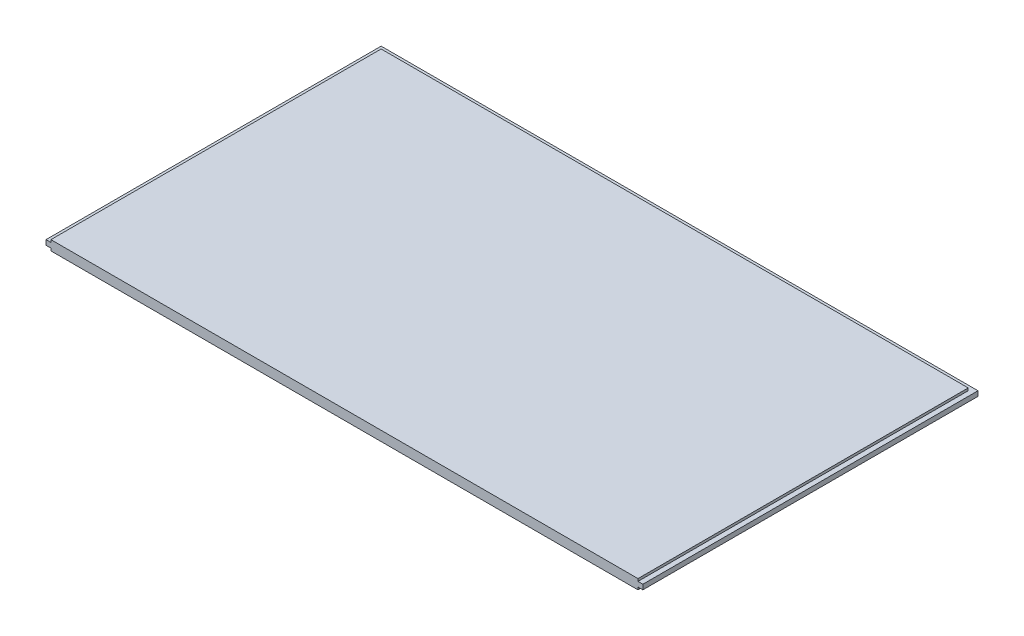
ISO-10303-21;
HEADER;
FILE_DESCRIPTION(('STEP AP214'),'2;1');
FILE_NAME('part.step','',(''),(''),'','','');
FILE_SCHEMA(('AUTOMOTIVE_DESIGN { 1 0 10303 214 1 1 1 1 }'));
ENDSEC;
DATA;
#1=APPLICATION_CONTEXT('core data for automotive mechanical design processes');
#2=APPLICATION_PROTOCOL_DEFINITION('international standard','automotive_design',2000,#1);
#3=PRODUCT_CONTEXT('',#1,'mechanical');
#4=PRODUCT('Part','Part','',(#3));
#5=PRODUCT_RELATED_PRODUCT_CATEGORY('part','',(#4));
#6=PRODUCT_DEFINITION_FORMATION('','',#4);
#7=PRODUCT_DEFINITION_CONTEXT('part definition',#1,'design');
#8=PRODUCT_DEFINITION('design','',#6,#7);
#9=PRODUCT_DEFINITION_SHAPE('','',#8);
#10=(LENGTH_UNIT() NAMED_UNIT(*) SI_UNIT(.MILLI.,.METRE.));
#11=(NAMED_UNIT(*) PLANE_ANGLE_UNIT() SI_UNIT($,.RADIAN.));
#12=(NAMED_UNIT(*) SI_UNIT($,.STERADIAN.) SOLID_ANGLE_UNIT());
#13=UNCERTAINTY_MEASURE_WITH_UNIT(LENGTH_MEASURE(1.E-05),#10,'distance_accuracy_value','');
#14=(GEOMETRIC_REPRESENTATION_CONTEXT(3) GLOBAL_UNCERTAINTY_ASSIGNED_CONTEXT((#13)) GLOBAL_UNIT_ASSIGNED_CONTEXT((#10,
#11,#12)) REPRESENTATION_CONTEXT('',''));
#15=CARTESIAN_POINT('',(0.,0.,0.));
#16=DIRECTION('',(0.,0.,1.));
#17=DIRECTION('',(1.,0.,0.));
#18=AXIS2_PLACEMENT_3D('',#15,#16,#17);
#19=CARTESIAN_POINT('',(-344.058306188925,12.7,-165.679153094463));
#20=DIRECTION('',(1.,0.,0.));
#21=DIRECTION('',(0.,0.,-1.));
#22=AXIS2_PLACEMENT_3D('',#19,#20,#21);
#23=PLANE('',#22);
#24=DIRECTION('',(0.,0.,-1.));
#25=VECTOR('',#24,1.);
#26=CARTESIAN_POINT('',(-344.058306188925,3.175,-165.679153094463));
#27=LINE('',#26,#25);
#28=CARTESIAN_POINT('',(-344.058306188925,3.17499999999991,269.295846905537));
#29=VERTEX_POINT('',#28);
#30=CARTESIAN_POINT('',(-344.058306188925,3.175,-165.679153094463));
#31=VERTEX_POINT('',#30);
#32=EDGE_CURVE('E199',#29,#31,#27,.T.);
#33=ORIENTED_EDGE('',*,*,#32,.F.);
#34=DIRECTION('',(0.,-1.,0.));
#35=VECTOR('',#34,1.);
#36=CARTESIAN_POINT('',(-344.058306188925,12.7,269.295846905537));
#37=LINE('',#36,#35);
#38=CARTESIAN_POINT('',(-344.058306188925,9.52500000000009,269.295846905537));
#39=VERTEX_POINT('',#38);
#40=EDGE_CURVE('E159',#39,#29,#37,.T.);
#41=ORIENTED_EDGE('',*,*,#40,.F.);
#42=DIRECTION('',(0.,0.,1.));
#43=VECTOR('',#42,1.);
#44=CARTESIAN_POINT('',(-344.058306188925,9.525,-165.679153094463));
#45=LINE('',#44,#43);
#46=CARTESIAN_POINT('',(-344.058306188925,9.525,-165.679153094463));
#47=VERTEX_POINT('',#46);
#48=EDGE_CURVE('E207',#47,#39,#45,.T.);
#49=ORIENTED_EDGE('',*,*,#48,.F.);
#50=DIRECTION('',(0.,-1.,0.));
#51=VECTOR('',#50,1.);
#52=CARTESIAN_POINT('',(-344.058306188925,12.7,-165.679153094463));
#53=LINE('',#52,#51);
#54=EDGE_CURVE('E142',#47,#31,#53,.T.);
#55=ORIENTED_EDGE('',*,*,#54,.T.);
#56=EDGE_LOOP('',(#33,#41,#49,#55));
#57=FACE_BOUND('',#56,.T.);
#58=ADVANCED_FACE('F33',(#57),#23,.F.);
#59=CARTESIAN_POINT('',(-344.058306188925,12.7,269.295846905537));
#60=DIRECTION('',(0.,0.,-1.));
#61=DIRECTION('',(-1.,0.,0.));
#62=AXIS2_PLACEMENT_3D('',#59,#60,#61);
#63=PLANE('',#62);
#64=DIRECTION('',(0.,-1.,0.));
#65=VECTOR('',#64,1.);
#66=CARTESIAN_POINT('',(430.641693811075,12.7,269.295846905537));
#67=LINE('',#66,#65);
#68=CARTESIAN_POINT('',(430.641693811075,9.52500000000009,269.295846905537));
#69=VERTEX_POINT('',#68);
#70=CARTESIAN_POINT('',(430.641693811075,3.17499999999991,269.295846905537));
#71=VERTEX_POINT('',#70);
#72=EDGE_CURVE('E157',#69,#71,#67,.T.);
#73=ORIENTED_EDGE('',*,*,#72,.F.);
#74=DIRECTION('',(1.,0.,0.));
#75=VECTOR('',#74,1.);
#76=CARTESIAN_POINT('',(430.641693811075,9.52500000000009,269.295846905537));
#77=LINE('',#76,#75);
#78=CARTESIAN_POINT('',(424.291693811075,9.52500000000009,269.295846905537));
#79=VERTEX_POINT('',#78);
#80=EDGE_CURVE('E128',#79,#69,#77,.T.);
#81=ORIENTED_EDGE('',*,*,#80,.F.);
#82=DIRECTION('',(0.,-1.,0.));
#83=VECTOR('',#82,1.);
#84=CARTESIAN_POINT('',(424.291693811075,12.7000000000001,269.295846905537));
#85=LINE('',#84,#83);
#86=CARTESIAN_POINT('',(424.291693811075,12.7000000000001,269.295846905537));
#87=VERTEX_POINT('',#86);
#88=EDGE_CURVE('E122',#87,#79,#85,.T.);
#89=ORIENTED_EDGE('',*,*,#88,.F.);
#90=DIRECTION('',(1.,0.,0.));
#91=VECTOR('',#90,1.);
#92=CARTESIAN_POINT('',(-344.058306188925,12.7,269.295846905537));
#93=LINE('',#92,#91);
#94=CARTESIAN_POINT('',(-337.708306188925,12.7000000000001,269.295846905537));
#95=VERTEX_POINT('',#94);
#96=EDGE_CURVE('E135',#95,#87,#93,.T.);
#97=ORIENTED_EDGE('',*,*,#96,.F.);
#98=DIRECTION('',(0.,1.,0.));
#99=VECTOR('',#98,1.);
#100=CARTESIAN_POINT('',(-337.708306188925,12.7000000000001,269.295846905537));
#101=LINE('',#100,#99);
#102=CARTESIAN_POINT('',(-337.708306188925,9.52500000000009,269.295846905537));
#103=VERTEX_POINT('',#102);
#104=EDGE_CURVE('E191',#103,#95,#101,.T.);
#105=ORIENTED_EDGE('',*,*,#104,.F.);
#106=DIRECTION('',(1.,0.,0.));
#107=VECTOR('',#106,1.);
#108=CARTESIAN_POINT('',(-344.058306188925,9.52500000000009,269.295846905537));
#109=LINE('',#108,#107);
#110=EDGE_CURVE('E183',#39,#103,#109,.T.);
#111=ORIENTED_EDGE('',*,*,#110,.F.);
#112=ORIENTED_EDGE('',*,*,#40,.T.);
#113=DIRECTION('',(-1.,0.,0.));
#114=VECTOR('',#113,1.);
#115=CARTESIAN_POINT('',(-344.058306188925,3.17499999999991,269.295846905537));
#116=LINE('',#115,#114);
#117=CARTESIAN_POINT('',(-337.708306188925,3.17499999999991,269.295846905537));
#118=VERTEX_POINT('',#117);
#119=EDGE_CURVE('E181',#118,#29,#116,.T.);
#120=ORIENTED_EDGE('',*,*,#119,.F.);
#121=DIRECTION('',(0.,1.,0.));
#122=VECTOR('',#121,1.);
#123=CARTESIAN_POINT('',(-337.708306188925,0.,269.295846905537));
#124=LINE('',#123,#122);
#125=CARTESIAN_POINT('',(-337.708306188925,0.,269.295846905537));
#126=VERTEX_POINT('',#125);
#127=EDGE_CURVE('E186',#126,#118,#124,.T.);
#128=ORIENTED_EDGE('',*,*,#127,.F.);
#129=DIRECTION('',(1.,0.,0.));
#130=VECTOR('',#129,1.);
#131=CARTESIAN_POINT('',(-344.058306188925,0.,269.295846905537));
#132=LINE('',#131,#130);
#133=CARTESIAN_POINT('',(424.291693811075,2.67494359995624E-12,269.295846905537));
#134=VERTEX_POINT('',#133);
#135=EDGE_CURVE('E143',#126,#134,#132,.T.);
#136=ORIENTED_EDGE('',*,*,#135,.T.);
#137=DIRECTION('',(0.,-1.,0.));
#138=VECTOR('',#137,1.);
#139=CARTESIAN_POINT('',(424.291693811075,2.67494359995624E-12,269.295846905537));
#140=LINE('',#139,#138);
#141=CARTESIAN_POINT('',(424.291693811075,3.17499999999991,269.295846905537));
#142=VERTEX_POINT('',#141);
#143=EDGE_CURVE('E237',#142,#134,#140,.T.);
#144=ORIENTED_EDGE('',*,*,#143,.F.);
#145=DIRECTION('',(-1.,0.,0.));
#146=VECTOR('',#145,1.);
#147=CARTESIAN_POINT('',(430.641693811075,3.17499999999991,269.295846905537));
#148=LINE('',#147,#146);
#149=EDGE_CURVE('E235',#71,#142,#148,.T.);
#150=ORIENTED_EDGE('',*,*,#149,.F.);
#151=EDGE_LOOP('',(#73,#81,#89,#97,#105,#111,#112,#120,#128,#136,#144,#150));
#152=FACE_BOUND('',#151,.T.);
#153=ADVANCED_FACE('F133',(#152),#63,.F.);
#154=CARTESIAN_POINT('',(430.641693811075,12.7,-165.679153094463));
#155=DIRECTION('',(-1.,0.,0.));
#156=DIRECTION('',(0.,0.,1.));
#157=AXIS2_PLACEMENT_3D('',#154,#155,#156);
#158=PLANE('',#157);
#159=DIRECTION('',(0.,0.,1.));
#160=VECTOR('',#159,1.);
#161=CARTESIAN_POINT('',(430.641693811075,9.525,-165.679153094463));
#162=LINE('',#161,#160);
#163=CARTESIAN_POINT('',(430.641693811075,9.525,-165.679153094463));
#164=VERTEX_POINT('',#163);
#165=EDGE_CURVE('E210',#164,#69,#162,.T.);
#166=ORIENTED_EDGE('',*,*,#165,.T.);
#167=ORIENTED_EDGE('',*,*,#72,.T.);
#168=DIRECTION('',(0.,0.,-1.));
#169=VECTOR('',#168,1.);
#170=CARTESIAN_POINT('',(430.641693811075,3.175,-165.679153094463));
#171=LINE('',#170,#169);
#172=CARTESIAN_POINT('',(430.641693811075,3.175,-165.679153094463));
#173=VERTEX_POINT('',#172);
#174=EDGE_CURVE('E200',#71,#173,#171,.T.);
#175=ORIENTED_EDGE('',*,*,#174,.T.);
#176=DIRECTION('',(0.,-1.,0.));
#177=VECTOR('',#176,1.);
#178=CARTESIAN_POINT('',(430.641693811075,12.7,-165.679153094463));
#179=LINE('',#178,#177);
#180=EDGE_CURVE('E146',#164,#173,#179,.T.);
#181=ORIENTED_EDGE('',*,*,#180,.F.);
#182=EDGE_LOOP('',(#166,#167,#175,#181));
#183=FACE_BOUND('',#182,.T.);
#184=ADVANCED_FACE('F250',(#183),#158,.F.);
#185=CARTESIAN_POINT('',(-344.058306188925,12.7,-165.679153094463));
#186=DIRECTION('',(0.,0.,1.));
#187=DIRECTION('',(1.,0.,0.));
#188=AXIS2_PLACEMENT_3D('',#185,#186,#187);
#189=PLANE('',#188);
#190=ORIENTED_EDGE('',*,*,#180,.T.);
#191=DIRECTION('',(-1.,0.,0.));
#192=VECTOR('',#191,1.);
#193=CARTESIAN_POINT('',(430.641693811075,3.175,-165.679153094463));
#194=LINE('',#193,#192);
#195=EDGE_CURVE('E205',#173,#31,#194,.T.);
#196=ORIENTED_EDGE('',*,*,#195,.T.);
#197=ORIENTED_EDGE('',*,*,#54,.F.);
#198=DIRECTION('',(-1.,0.,0.));
#199=VECTOR('',#198,1.);
#200=CARTESIAN_POINT('',(430.641693811075,9.525,-165.679153094463));
#201=LINE('',#200,#199);
#202=EDGE_CURVE('E152',#164,#47,#201,.T.);
#203=ORIENTED_EDGE('',*,*,#202,.F.);
#204=EDGE_LOOP('',(#190,#196,#197,#203));
#205=FACE_BOUND('',#204,.T.);
#206=ADVANCED_FACE('F227',(#205),#189,.F.);
#207=CARTESIAN_POINT('',(0.,12.7,0.));
#208=DIRECTION('',(0.,1.,0.));
#209=DIRECTION('',(0.,0.,1.));
#210=AXIS2_PLACEMENT_3D('',#207,#208,#209);
#211=PLANE('',#210);
#212=DIRECTION('',(0.,0.,1.));
#213=VECTOR('',#212,1.);
#214=CARTESIAN_POINT('',(424.291693811075,12.7000000000001,-165.679153094463));
#215=LINE('',#214,#213);
#216=CARTESIAN_POINT('',(424.291693811075,12.7000000000001,-159.329153094463));
#217=VERTEX_POINT('',#216);
#218=EDGE_CURVE('E119',#217,#87,#215,.T.);
#219=ORIENTED_EDGE('',*,*,#218,.F.);
#220=DIRECTION('',(-1.,0.,0.));
#221=VECTOR('',#220,1.);
#222=CARTESIAN_POINT('',(430.641693811075,12.7,-159.329153094463));
#223=LINE('',#222,#221);
#224=CARTESIAN_POINT('',(-337.708306188925,12.7000000000001,-159.329153094463));
#225=VERTEX_POINT('',#224);
#226=EDGE_CURVE('E149',#217,#225,#223,.T.);
#227=ORIENTED_EDGE('',*,*,#226,.T.);
#228=DIRECTION('',(0.,0.,1.));
#229=VECTOR('',#228,1.);
#230=CARTESIAN_POINT('',(-337.708306188925,12.7000000000001,-165.679153094463));
#231=LINE('',#230,#229);
#232=EDGE_CURVE('E141',#225,#95,#231,.T.);
#233=ORIENTED_EDGE('',*,*,#232,.T.);
#234=ORIENTED_EDGE('',*,*,#96,.T.);
#235=EDGE_LOOP('',(#219,#227,#233,#234));
#236=FACE_BOUND('',#235,.T.);
#237=ADVANCED_FACE('F139',(#236),#211,.T.);
#238=CARTESIAN_POINT('',(0.,0.,0.));
#239=DIRECTION('',(0.,1.,0.));
#240=DIRECTION('',(0.,0.,1.));
#241=AXIS2_PLACEMENT_3D('',#238,#239,#240);
#242=PLANE('',#241);
#243=DIRECTION('',(-1.,0.,0.));
#244=VECTOR('',#243,1.);
#245=CARTESIAN_POINT('',(430.641693811075,0.,-159.329153094463));
#246=LINE('',#245,#244);
#247=CARTESIAN_POINT('',(424.291693811075,2.67494359995624E-12,-159.329153094463));
#248=VERTEX_POINT('',#247);
#249=CARTESIAN_POINT('',(-337.708306188925,0.,-159.329153094463));
#250=VERTEX_POINT('',#249);
#251=EDGE_CURVE('E168',#248,#250,#246,.T.);
#252=ORIENTED_EDGE('',*,*,#251,.F.);
#253=DIRECTION('',(0.,0.,1.));
#254=VECTOR('',#253,1.);
#255=CARTESIAN_POINT('',(424.291693811075,2.67494359995624E-12,-165.679153094463));
#256=LINE('',#255,#254);
#257=EDGE_CURVE('E242',#248,#134,#256,.T.);
#258=ORIENTED_EDGE('',*,*,#257,.T.);
#259=ORIENTED_EDGE('',*,*,#135,.F.);
#260=DIRECTION('',(0.,0.,1.));
#261=VECTOR('',#260,1.);
#262=CARTESIAN_POINT('',(-337.708306188925,0.,-165.679153094463));
#263=LINE('',#262,#261);
#264=EDGE_CURVE('E174',#250,#126,#263,.T.);
#265=ORIENTED_EDGE('',*,*,#264,.F.);
#266=EDGE_LOOP('',(#252,#258,#259,#265));
#267=FACE_BOUND('',#266,.T.);
#268=ADVANCED_FACE('F179',(#267),#242,.F.);
#269=CARTESIAN_POINT('',(430.641693811075,12.7,-159.329153094463));
#270=DIRECTION('',(0.,0.,1.));
#271=DIRECTION('',(1.,0.,0.));
#272=AXIS2_PLACEMENT_3D('',#269,#270,#271);
#273=PLANE('',#272);
#274=ORIENTED_EDGE('',*,*,#226,.F.);
#275=DIRECTION('',(0.,-1.,0.));
#276=VECTOR('',#275,1.);
#277=CARTESIAN_POINT('',(424.291693811075,12.7,-159.329153094463));
#278=LINE('',#277,#276);
#279=CARTESIAN_POINT('',(424.291693811075,9.525,-159.329153094463));
#280=VERTEX_POINT('',#279);
#281=EDGE_CURVE('E124',#217,#280,#278,.T.);
#282=ORIENTED_EDGE('',*,*,#281,.T.);
#283=DIRECTION('',(-1.,0.,0.));
#284=VECTOR('',#283,1.);
#285=CARTESIAN_POINT('',(430.641693811075,9.525,-159.329153094463));
#286=LINE('',#285,#284);
#287=CARTESIAN_POINT('',(-337.708306188925,9.525,-159.329153094463));
#288=VERTEX_POINT('',#287);
#289=EDGE_CURVE('E213',#280,#288,#286,.T.);
#290=ORIENTED_EDGE('',*,*,#289,.T.);
#291=DIRECTION('',(0.,1.,0.));
#292=VECTOR('',#291,1.);
#293=CARTESIAN_POINT('',(-337.708306188925,12.7,-159.329153094463));
#294=LINE('',#293,#292);
#295=EDGE_CURVE('E195',#288,#225,#294,.T.);
#296=ORIENTED_EDGE('',*,*,#295,.T.);
#297=EDGE_LOOP('',(#274,#282,#290,#296));
#298=FACE_BOUND('',#297,.T.);
#299=ADVANCED_FACE('F234',(#298),#273,.F.);
#300=CARTESIAN_POINT('',(430.641693811075,9.525,-165.679153094463));
#301=DIRECTION('',(0.,-1.,0.));
#302=DIRECTION('',(0.,0.,-1.));
#303=AXIS2_PLACEMENT_3D('',#300,#301,#302);
#304=PLANE('',#303);
#305=ORIENTED_EDGE('',*,*,#289,.F.);
#306=DIRECTION('',(0.,0.,1.));
#307=VECTOR('',#306,1.);
#308=CARTESIAN_POINT('',(424.291693811075,9.52500000000009,-165.679153094463));
#309=LINE('',#308,#307);
#310=EDGE_CURVE('E47',#280,#79,#309,.T.);
#311=ORIENTED_EDGE('',*,*,#310,.T.);
#312=ORIENTED_EDGE('',*,*,#80,.T.);
#313=ORIENTED_EDGE('',*,*,#165,.F.);
#314=ORIENTED_EDGE('',*,*,#202,.T.);
#315=ORIENTED_EDGE('',*,*,#48,.T.);
#316=ORIENTED_EDGE('',*,*,#110,.T.);
#317=DIRECTION('',(0.,0.,1.));
#318=VECTOR('',#317,1.);
#319=CARTESIAN_POINT('',(-337.708306188925,9.52500000000009,-165.679153094463));
#320=LINE('',#319,#318);
#321=EDGE_CURVE('E193',#288,#103,#320,.T.);
#322=ORIENTED_EDGE('',*,*,#321,.F.);
#323=EDGE_LOOP('',(#305,#311,#312,#313,#314,#315,#316,#322));
#324=FACE_BOUND('',#323,.T.);
#325=ADVANCED_FACE('F220',(#324),#304,.F.);
#326=CARTESIAN_POINT('',(430.641693811075,3.175,-165.679153094463));
#327=DIRECTION('',(0.,1.,0.));
#328=DIRECTION('',(0.,0.,1.));
#329=AXIS2_PLACEMENT_3D('',#326,#327,#328);
#330=PLANE('',#329);
#331=ORIENTED_EDGE('',*,*,#32,.T.);
#332=ORIENTED_EDGE('',*,*,#195,.F.);
#333=ORIENTED_EDGE('',*,*,#174,.F.);
#334=ORIENTED_EDGE('',*,*,#149,.T.);
#335=DIRECTION('',(0.,0.,1.));
#336=VECTOR('',#335,1.);
#337=CARTESIAN_POINT('',(424.291693811075,3.17499999999991,-165.679153094463));
#338=LINE('',#337,#336);
#339=CARTESIAN_POINT('',(424.291693811075,3.175,-159.329153094463));
#340=VERTEX_POINT('',#339);
#341=EDGE_CURVE('E55',#340,#142,#338,.T.);
#342=ORIENTED_EDGE('',*,*,#341,.F.);
#343=DIRECTION('',(-1.,0.,0.));
#344=VECTOR('',#343,1.);
#345=CARTESIAN_POINT('',(430.641693811075,3.175,-159.329153094463));
#346=LINE('',#345,#344);
#347=CARTESIAN_POINT('',(-337.708306188925,3.175,-159.329153094463));
#348=VERTEX_POINT('',#347);
#349=EDGE_CURVE('E166',#340,#348,#346,.T.);
#350=ORIENTED_EDGE('',*,*,#349,.T.);
#351=DIRECTION('',(0.,0.,1.));
#352=VECTOR('',#351,1.);
#353=CARTESIAN_POINT('',(-337.708306188925,3.17499999999991,-165.679153094463));
#354=LINE('',#353,#352);
#355=EDGE_CURVE('E176',#348,#118,#354,.T.);
#356=ORIENTED_EDGE('',*,*,#355,.T.);
#357=ORIENTED_EDGE('',*,*,#119,.T.);
#358=EDGE_LOOP('',(#331,#332,#333,#334,#342,#350,#356,#357));
#359=FACE_BOUND('',#358,.T.);
#360=ADVANCED_FACE('F229',(#359),#330,.F.);
#361=CARTESIAN_POINT('',(430.641693811075,0.,-159.329153094463));
#362=DIRECTION('',(0.,0.,1.));
#363=DIRECTION('',(1.,0.,0.));
#364=AXIS2_PLACEMENT_3D('',#361,#362,#363);
#365=PLANE('',#364);
#366=ORIENTED_EDGE('',*,*,#349,.F.);
#367=DIRECTION('',(0.,-1.,0.));
#368=VECTOR('',#367,1.);
#369=CARTESIAN_POINT('',(424.291693811075,2.22044604925228E-13,-159.329153094463));
#370=LINE('',#369,#368);
#371=EDGE_CURVE('E11',#340,#248,#370,.T.);
#372=ORIENTED_EDGE('',*,*,#371,.T.);
#373=ORIENTED_EDGE('',*,*,#251,.T.);
#374=DIRECTION('',(0.,1.,0.));
#375=VECTOR('',#374,1.);
#376=CARTESIAN_POINT('',(-337.708306188925,0.,-159.329153094463));
#377=LINE('',#376,#375);
#378=EDGE_CURVE('E40',#250,#348,#377,.T.);
#379=ORIENTED_EDGE('',*,*,#378,.T.);
#380=EDGE_LOOP('',(#366,#372,#373,#379));
#381=FACE_BOUND('',#380,.T.);
#382=ADVANCED_FACE('F165',(#381),#365,.F.);
#383=CARTESIAN_POINT('',(-337.708306188925,12.7000000000001,-165.679153094463));
#384=DIRECTION('',(1.,0.,0.));
#385=DIRECTION('',(0.,0.,-1.));
#386=AXIS2_PLACEMENT_3D('',#383,#384,#385);
#387=PLANE('',#386);
#388=ORIENTED_EDGE('',*,*,#321,.T.);
#389=ORIENTED_EDGE('',*,*,#104,.T.);
#390=ORIENTED_EDGE('',*,*,#232,.F.);
#391=ORIENTED_EDGE('',*,*,#295,.F.);
#392=EDGE_LOOP('',(#388,#389,#390,#391));
#393=FACE_BOUND('',#392,.T.);
#394=ADVANCED_FACE('F233',(#393),#387,.F.);
#395=CARTESIAN_POINT('',(-337.708306188925,0.,-165.679153094463));
#396=DIRECTION('',(1.,0.,0.));
#397=DIRECTION('',(0.,0.,-1.));
#398=AXIS2_PLACEMENT_3D('',#395,#396,#397);
#399=PLANE('',#398);
#400=ORIENTED_EDGE('',*,*,#264,.T.);
#401=ORIENTED_EDGE('',*,*,#127,.T.);
#402=ORIENTED_EDGE('',*,*,#355,.F.);
#403=ORIENTED_EDGE('',*,*,#378,.F.);
#404=EDGE_LOOP('',(#400,#401,#402,#403));
#405=FACE_BOUND('',#404,.T.);
#406=ADVANCED_FACE('F172',(#405),#399,.F.);
#407=CARTESIAN_POINT('',(424.291693811075,2.67494359995624E-12,-165.679153094463));
#408=DIRECTION('',(-1.,0.,0.));
#409=DIRECTION('',(0.,-1.,0.));
#410=AXIS2_PLACEMENT_3D('',#407,#408,#409);
#411=PLANE('',#410);
#412=ORIENTED_EDGE('',*,*,#341,.T.);
#413=ORIENTED_EDGE('',*,*,#143,.T.);
#414=ORIENTED_EDGE('',*,*,#257,.F.);
#415=ORIENTED_EDGE('',*,*,#371,.F.);
#416=EDGE_LOOP('',(#412,#413,#414,#415));
#417=FACE_BOUND('',#416,.T.);
#418=ADVANCED_FACE('F248',(#417),#411,.F.);
#419=CARTESIAN_POINT('',(424.291693811075,12.7000000000001,-165.679153094463));
#420=DIRECTION('',(-1.,0.,0.));
#421=DIRECTION('',(0.,0.,1.));
#422=AXIS2_PLACEMENT_3D('',#419,#420,#421);
#423=PLANE('',#422);
#424=ORIENTED_EDGE('',*,*,#218,.T.);
#425=ORIENTED_EDGE('',*,*,#88,.T.);
#426=ORIENTED_EDGE('',*,*,#310,.F.);
#427=ORIENTED_EDGE('',*,*,#281,.F.);
#428=EDGE_LOOP('',(#424,#425,#426,#427));
#429=FACE_BOUND('',#428,.T.);
#430=ADVANCED_FACE('F121',(#429),#423,.F.);
#431=CLOSED_SHELL('',(#58,#153,#184,#206,#237,#268,#299,#325,#360,#382,#394,#406,#418,#430));
#432=MANIFOLD_SOLID_BREP('B2',#431);
#433=ADVANCED_BREP_SHAPE_REPRESENTATION('',(#18,#432),#14);
#434=SHAPE_DEFINITION_REPRESENTATION(#9,#433);
ENDSEC;
END-ISO-10303-21;
